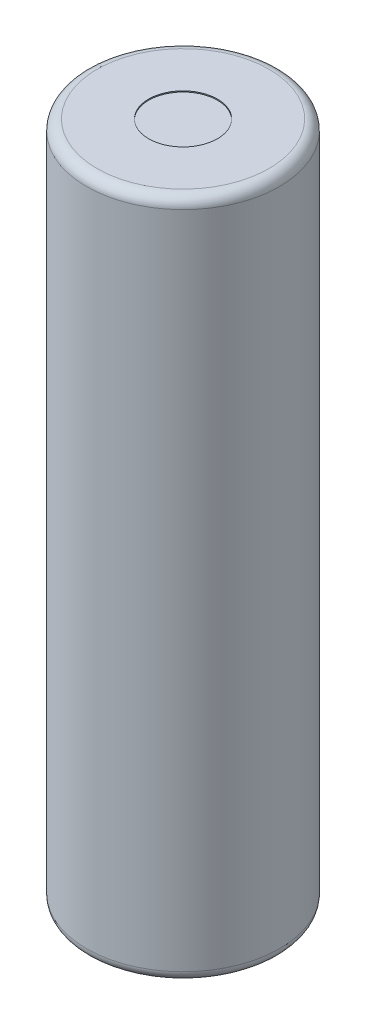
ISO-10303-21;
HEADER;
FILE_DESCRIPTION(('STEP AP214'),'2;1');
FILE_NAME('part.step','',(''),(''),'','','');
FILE_SCHEMA(('AUTOMOTIVE_DESIGN { 1 0 10303 214 1 1 1 1 }'));
ENDSEC;
DATA;
#1=APPLICATION_CONTEXT('core data for automotive mechanical design processes');
#2=APPLICATION_PROTOCOL_DEFINITION('international standard','automotive_design',2000,#1);
#3=PRODUCT_CONTEXT('',#1,'mechanical');
#4=PRODUCT('Part','Part','',(#3));
#5=PRODUCT_RELATED_PRODUCT_CATEGORY('part','',(#4));
#6=PRODUCT_DEFINITION_FORMATION('','',#4);
#7=PRODUCT_DEFINITION_CONTEXT('part definition',#1,'design');
#8=PRODUCT_DEFINITION('design','',#6,#7);
#9=PRODUCT_DEFINITION_SHAPE('','',#8);
#10=(LENGTH_UNIT() NAMED_UNIT(*) SI_UNIT(.MILLI.,.METRE.));
#11=(NAMED_UNIT(*) PLANE_ANGLE_UNIT() SI_UNIT($,.RADIAN.));
#12=(NAMED_UNIT(*) SI_UNIT($,.STERADIAN.) SOLID_ANGLE_UNIT());
#13=UNCERTAINTY_MEASURE_WITH_UNIT(LENGTH_MEASURE(1.E-05),#10,'distance_accuracy_value','');
#14=(GEOMETRIC_REPRESENTATION_CONTEXT(3) GLOBAL_UNCERTAINTY_ASSIGNED_CONTEXT((#13)) GLOBAL_UNIT_ASSIGNED_CONTEXT((#10,
#11,#12)) REPRESENTATION_CONTEXT('',''));
#15=CARTESIAN_POINT('',(0.,0.,0.));
#16=DIRECTION('',(0.,0.,1.));
#17=DIRECTION('',(1.,0.,0.));
#18=AXIS2_PLACEMENT_3D('',#15,#16,#17);
#19=CARTESIAN_POINT('',(0.,32.65,0.));
#20=DIRECTION('',(0.,-1.,0.));
#21=DIRECTION('',(0.,0.,-1.));
#22=AXIS2_PLACEMENT_3D('',#19,#20,#21);
#23=CYLINDRICAL_SURFACE('',#22,9.25);
#24=CARTESIAN_POINT('',(0.,-31.65,0.));
#25=DIRECTION('',(0.,1.,0.));
#26=DIRECTION('',(0.,0.,1.));
#27=AXIS2_PLACEMENT_3D('',#24,#25,#26);
#28=CIRCLE('',#27,9.25);
#29=CARTESIAN_POINT('',(0.,-31.65,9.25));
#30=VERTEX_POINT('',#29);
#31=EDGE_CURVE('E56',#30,#30,#28,.T.);
#32=ORIENTED_EDGE('',*,*,#31,.T.);
#33=EDGE_LOOP('',(#32));
#34=FACE_BOUND('',#33,.T.);
#35=CARTESIAN_POINT('',(0.,31.65,0.));
#36=DIRECTION('',(0.,1.,0.));
#37=DIRECTION('',(0.,0.,1.));
#38=AXIS2_PLACEMENT_3D('',#35,#36,#37);
#39=CIRCLE('',#38,9.25);
#40=CARTESIAN_POINT('',(0.,31.65,9.25));
#41=VERTEX_POINT('',#40);
#42=EDGE_CURVE('E59',#41,#41,#39,.F.);
#43=ORIENTED_EDGE('',*,*,#42,.T.);
#44=EDGE_LOOP('',(#43));
#45=FACE_BOUND('',#44,.T.);
#46=ADVANCED_FACE('F33',(#34,#45),#23,.T.);
#47=CARTESIAN_POINT('',(0.,32.65,0.));
#48=DIRECTION('',(0.,1.,0.));
#49=DIRECTION('',(0.,0.,1.));
#50=AXIS2_PLACEMENT_3D('',#47,#48,#49);
#51=PLANE('',#50);
#52=CARTESIAN_POINT('',(0.,32.65,0.));
#53=DIRECTION('',(0.,1.,0.));
#54=DIRECTION('',(0.,0.,1.));
#55=AXIS2_PLACEMENT_3D('',#52,#53,#54);
#56=CIRCLE('',#55,3.3);
#57=CARTESIAN_POINT('',(0.,32.65,3.3));
#58=VERTEX_POINT('',#57);
#59=EDGE_CURVE('E63',#58,#58,#56,.T.);
#60=ORIENTED_EDGE('',*,*,#59,.F.);
#61=EDGE_LOOP('',(#60));
#62=FACE_BOUND('',#61,.T.);
#63=CARTESIAN_POINT('',(0.,32.65,0.));
#64=DIRECTION('',(0.,1.,0.));
#65=DIRECTION('',(0.,0.,1.));
#66=AXIS2_PLACEMENT_3D('',#63,#64,#65);
#67=CIRCLE('',#66,8.25);
#68=CARTESIAN_POINT('',(0.,32.65,8.25));
#69=VERTEX_POINT('',#68);
#70=EDGE_CURVE('E48',#69,#69,#67,.T.);
#71=ORIENTED_EDGE('',*,*,#70,.T.);
#72=EDGE_LOOP('',(#71));
#73=FACE_BOUND('',#72,.T.);
#74=ADVANCED_FACE('F78',(#62,#73),#51,.T.);
#75=CARTESIAN_POINT('',(0.,-32.65,0.));
#76=DIRECTION('',(0.,1.,0.));
#77=DIRECTION('',(0.,0.,1.));
#78=AXIS2_PLACEMENT_3D('',#75,#76,#77);
#79=PLANE('',#78);
#80=CARTESIAN_POINT('',(0.,-32.65,0.));
#81=DIRECTION('',(0.,1.,0.));
#82=DIRECTION('',(0.,0.,1.));
#83=AXIS2_PLACEMENT_3D('',#80,#81,#82);
#84=CIRCLE('',#83,3.3);
#85=CARTESIAN_POINT('',(0.,-32.65,3.3));
#86=VERTEX_POINT('',#85);
#87=EDGE_CURVE('E44',#86,#86,#84,.F.);
#88=ORIENTED_EDGE('',*,*,#87,.F.);
#89=EDGE_LOOP('',(#88));
#90=FACE_BOUND('',#89,.T.);
#91=CARTESIAN_POINT('',(0.,-32.65,0.));
#92=DIRECTION('',(0.,1.,0.));
#93=DIRECTION('',(0.,0.,1.));
#94=AXIS2_PLACEMENT_3D('',#91,#92,#93);
#95=CIRCLE('',#94,8.25);
#96=CARTESIAN_POINT('',(0.,-32.65,8.25));
#97=VERTEX_POINT('',#96);
#98=EDGE_CURVE('E53',#97,#97,#95,.F.);
#99=ORIENTED_EDGE('',*,*,#98,.T.);
#100=EDGE_LOOP('',(#99));
#101=FACE_BOUND('',#100,.T.);
#102=ADVANCED_FACE('F81',(#90,#101),#79,.F.);
#103=CARTESIAN_POINT('',(0.,-31.65,0.));
#104=DIRECTION('',(0.,1.,0.));
#105=DIRECTION('',(0.,0.,1.));
#106=AXIS2_PLACEMENT_3D('',#103,#104,#105);
#107=TOROIDAL_SURFACE('',#106,8.25,1.);
#108=ORIENTED_EDGE('',*,*,#98,.F.);
#109=EDGE_LOOP('',(#108));
#110=FACE_BOUND('',#109,.T.);
#111=ORIENTED_EDGE('',*,*,#31,.F.);
#112=EDGE_LOOP('',(#111));
#113=FACE_BOUND('',#112,.T.);
#114=ADVANCED_FACE('F86',(#110,#113),#107,.T.);
#115=CARTESIAN_POINT('',(0.,31.65,0.));
#116=DIRECTION('',(0.,1.,0.));
#117=DIRECTION('',(0.,0.,1.));
#118=AXIS2_PLACEMENT_3D('',#115,#116,#117);
#119=TOROIDAL_SURFACE('',#118,8.25,1.);
#120=ORIENTED_EDGE('',*,*,#42,.F.);
#121=EDGE_LOOP('',(#120));
#122=FACE_BOUND('',#121,.T.);
#123=ORIENTED_EDGE('',*,*,#70,.F.);
#124=EDGE_LOOP('',(#123));
#125=FACE_BOUND('',#124,.T.);
#126=ADVANCED_FACE('F74',(#122,#125),#119,.T.);
#127=CARTESIAN_POINT('',(0.,32.55,0.));
#128=DIRECTION('',(0.,1.,0.));
#129=DIRECTION('',(0.,0.,1.));
#130=AXIS2_PLACEMENT_3D('',#127,#128,#129);
#131=CYLINDRICAL_SURFACE('',#130,3.3);
#132=CARTESIAN_POINT('',(0.,32.55,0.));
#133=DIRECTION('',(0.,1.,0.));
#134=DIRECTION('',(0.,0.,1.));
#135=AXIS2_PLACEMENT_3D('',#132,#133,#134);
#136=CIRCLE('',#135,3.3);
#137=CARTESIAN_POINT('',(0.,32.55,3.3));
#138=VERTEX_POINT('',#137);
#139=EDGE_CURVE('E62',#138,#138,#136,.T.);
#140=ORIENTED_EDGE('',*,*,#139,.F.);
#141=EDGE_LOOP('',(#140));
#142=FACE_BOUND('',#141,.T.);
#143=ORIENTED_EDGE('',*,*,#59,.T.);
#144=EDGE_LOOP('',(#143));
#145=FACE_BOUND('',#144,.T.);
#146=ADVANCED_FACE('F71',(#142,#145),#131,.F.);
#147=CARTESIAN_POINT('',(0.,32.55,0.));
#148=DIRECTION('',(0.,1.,0.));
#149=DIRECTION('',(0.,0.,1.));
#150=AXIS2_PLACEMENT_3D('',#147,#148,#149);
#151=PLANE('',#150);
#152=ORIENTED_EDGE('',*,*,#139,.T.);
#153=EDGE_LOOP('',(#152));
#154=FACE_BOUND('',#153,.T.);
#155=ADVANCED_FACE('F69',(#154),#151,.T.);
#156=CARTESIAN_POINT('',(0.,-33.15,0.));
#157=DIRECTION('',(0.,1.,0.));
#158=DIRECTION('',(0.,0.,1.));
#159=AXIS2_PLACEMENT_3D('',#156,#157,#158);
#160=CYLINDRICAL_SURFACE('',#159,3.3);
#161=CARTESIAN_POINT('',(0.,-32.9,0.));
#162=DIRECTION('',(0.,-1.,0.));
#163=DIRECTION('',(0.,0.,-1.));
#164=AXIS2_PLACEMENT_3D('',#161,#162,#163);
#165=CIRCLE('',#164,3.3);
#166=CARTESIAN_POINT('',(0.,-32.9,-3.3));
#167=VERTEX_POINT('',#166);
#168=EDGE_CURVE('E10',#167,#167,#165,.F.);
#169=ORIENTED_EDGE('',*,*,#168,.T.);
#170=EDGE_LOOP('',(#169));
#171=FACE_BOUND('',#170,.T.);
#172=ORIENTED_EDGE('',*,*,#87,.T.);
#173=EDGE_LOOP('',(#172));
#174=FACE_BOUND('',#173,.T.);
#175=ADVANCED_FACE('F106',(#171,#174),#160,.T.);
#176=CARTESIAN_POINT('',(0.,-33.15,0.));
#177=DIRECTION('',(0.,-1.,0.));
#178=DIRECTION('',(0.,0.,-1.));
#179=AXIS2_PLACEMENT_3D('',#176,#177,#178);
#180=PLANE('',#179);
#181=CARTESIAN_POINT('',(0.,-33.15,0.));
#182=DIRECTION('',(0.,-1.,0.));
#183=DIRECTION('',(0.,0.,-1.));
#184=AXIS2_PLACEMENT_3D('',#181,#182,#183);
#185=CIRCLE('',#184,3.05);
#186=CARTESIAN_POINT('',(0.,-33.15,-3.05));
#187=VERTEX_POINT('',#186);
#188=EDGE_CURVE('E40',#187,#187,#185,.T.);
#189=ORIENTED_EDGE('',*,*,#188,.T.);
#190=EDGE_LOOP('',(#189));
#191=FACE_BOUND('',#190,.T.);
#192=ADVANCED_FACE('F109',(#191),#180,.T.);
#193=CARTESIAN_POINT('',(0.,-32.9,0.));
#194=DIRECTION('',(0.,-1.,0.));
#195=DIRECTION('',(0.,0.,-1.));
#196=AXIS2_PLACEMENT_3D('',#193,#194,#195);
#197=TOROIDAL_SURFACE('',#196,3.05,0.25);
#198=ORIENTED_EDGE('',*,*,#168,.F.);
#199=EDGE_LOOP('',(#198));
#200=FACE_BOUND('',#199,.T.);
#201=ORIENTED_EDGE('',*,*,#188,.F.);
#202=EDGE_LOOP('',(#201));
#203=FACE_BOUND('',#202,.T.);
#204=ADVANCED_FACE('F35',(#200,#203),#197,.T.);
#205=CLOSED_SHELL('',(#46,#74,#102,#114,#126,#146,#155,#175,#192,#204));
#206=MANIFOLD_SOLID_BREP('B2',#205);
#207=ADVANCED_BREP_SHAPE_REPRESENTATION('',(#18,#206),#14);
#208=SHAPE_DEFINITION_REPRESENTATION(#9,#207);
ENDSEC;
END-ISO-10303-21;
